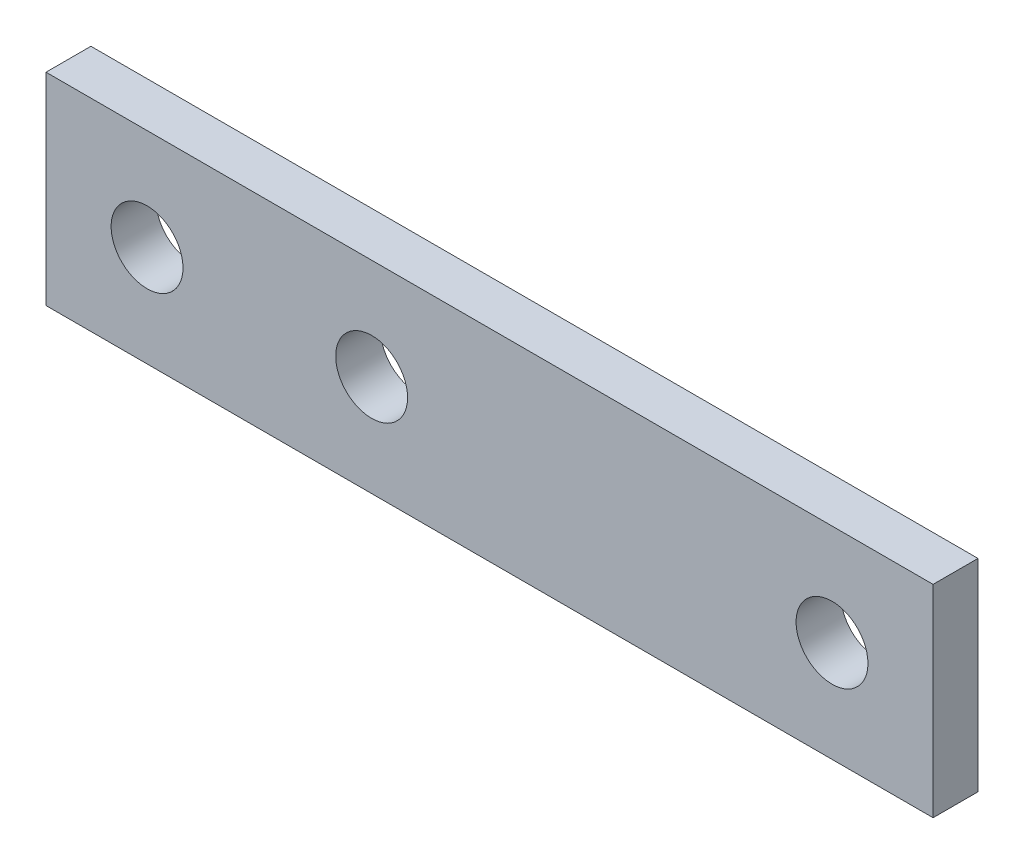
ISO-10303-21;
HEADER;
FILE_DESCRIPTION(('STEP AP214'),'2;1');
FILE_NAME('part.step','',(''),(''),'','','');
FILE_SCHEMA(('AUTOMOTIVE_DESIGN { 1 0 10303 214 1 1 1 1 }'));
ENDSEC;
DATA;
#1=APPLICATION_CONTEXT('core data for automotive mechanical design processes');
#2=APPLICATION_PROTOCOL_DEFINITION('international standard','automotive_design',2000,#1);
#3=PRODUCT_CONTEXT('',#1,'mechanical');
#4=PRODUCT('Part','Part','',(#3));
#5=PRODUCT_RELATED_PRODUCT_CATEGORY('part','',(#4));
#6=PRODUCT_DEFINITION_FORMATION('','',#4);
#7=PRODUCT_DEFINITION_CONTEXT('part definition',#1,'design');
#8=PRODUCT_DEFINITION('design','',#6,#7);
#9=PRODUCT_DEFINITION_SHAPE('','',#8);
#10=(LENGTH_UNIT() NAMED_UNIT(*) SI_UNIT(.MILLI.,.METRE.));
#11=(NAMED_UNIT(*) PLANE_ANGLE_UNIT() SI_UNIT($,.RADIAN.));
#12=(NAMED_UNIT(*) SI_UNIT($,.STERADIAN.) SOLID_ANGLE_UNIT());
#13=UNCERTAINTY_MEASURE_WITH_UNIT(LENGTH_MEASURE(1.E-05),#10,'distance_accuracy_value','');
#14=(GEOMETRIC_REPRESENTATION_CONTEXT(3) GLOBAL_UNCERTAINTY_ASSIGNED_CONTEXT((#13)) GLOBAL_UNIT_ASSIGNED_CONTEXT((#10,
#11,#12)) REPRESENTATION_CONTEXT('',''));
#15=CARTESIAN_POINT('',(0.,0.,0.));
#16=DIRECTION('',(0.,0.,1.));
#17=DIRECTION('',(1.,0.,0.));
#18=AXIS2_PLACEMENT_3D('',#15,#16,#17);
#19=CARTESIAN_POINT('',(19.75,4.5,2.));
#20=DIRECTION('',(-1.,0.,0.));
#21=DIRECTION('',(0.,0.,1.));
#22=AXIS2_PLACEMENT_3D('',#19,#20,#21);
#23=PLANE('',#22);
#24=DIRECTION('',(0.,1.,0.));
#25=VECTOR('',#24,1.);
#26=CARTESIAN_POINT('',(19.75,4.5,0.));
#27=LINE('',#26,#25);
#28=CARTESIAN_POINT('',(19.75,-4.5,0.));
#29=VERTEX_POINT('',#28);
#30=CARTESIAN_POINT('',(19.75,4.5,0.));
#31=VERTEX_POINT('',#30);
#32=EDGE_CURVE('E107',#29,#31,#27,.T.);
#33=ORIENTED_EDGE('',*,*,#32,.T.);
#34=DIRECTION('',(0.,0.,-1.));
#35=VECTOR('',#34,1.);
#36=CARTESIAN_POINT('',(19.75,4.5,2.));
#37=LINE('',#36,#35);
#38=CARTESIAN_POINT('',(19.75,4.5,2.));
#39=VERTEX_POINT('',#38);
#40=EDGE_CURVE('E11',#39,#31,#37,.T.);
#41=ORIENTED_EDGE('',*,*,#40,.F.);
#42=DIRECTION('',(0.,1.,0.));
#43=VECTOR('',#42,1.);
#44=CARTESIAN_POINT('',(19.75,4.5,2.));
#45=LINE('',#44,#43);
#46=CARTESIAN_POINT('',(19.75,-4.5,2.));
#47=VERTEX_POINT('',#46);
#48=EDGE_CURVE('E91',#47,#39,#45,.T.);
#49=ORIENTED_EDGE('',*,*,#48,.F.);
#50=DIRECTION('',(0.,0.,-1.));
#51=VECTOR('',#50,1.);
#52=CARTESIAN_POINT('',(19.75,-4.5,2.));
#53=LINE('',#52,#51);
#54=EDGE_CURVE('E103',#47,#29,#53,.T.);
#55=ORIENTED_EDGE('',*,*,#54,.T.);
#56=EDGE_LOOP('',(#33,#41,#49,#55));
#57=FACE_BOUND('',#56,.T.);
#58=ADVANCED_FACE('F39',(#57),#23,.F.);
#59=CARTESIAN_POINT('',(-19.75,4.5,2.));
#60=DIRECTION('',(0.,-1.,0.));
#61=DIRECTION('',(0.,0.,-1.));
#62=AXIS2_PLACEMENT_3D('',#59,#60,#61);
#63=PLANE('',#62);
#64=DIRECTION('',(-1.,0.,0.));
#65=VECTOR('',#64,1.);
#66=CARTESIAN_POINT('',(-19.75,4.5,0.));
#67=LINE('',#66,#65);
#68=CARTESIAN_POINT('',(-19.75,4.5,0.));
#69=VERTEX_POINT('',#68);
#70=EDGE_CURVE('E96',#31,#69,#67,.T.);
#71=ORIENTED_EDGE('',*,*,#70,.T.);
#72=DIRECTION('',(0.,0.,-1.));
#73=VECTOR('',#72,1.);
#74=CARTESIAN_POINT('',(-19.75,4.5,2.));
#75=LINE('',#74,#73);
#76=CARTESIAN_POINT('',(-19.75,4.5,2.));
#77=VERTEX_POINT('',#76);
#78=EDGE_CURVE('E48',#77,#69,#75,.T.);
#79=ORIENTED_EDGE('',*,*,#78,.F.);
#80=DIRECTION('',(-1.,0.,0.));
#81=VECTOR('',#80,1.);
#82=CARTESIAN_POINT('',(-19.75,4.5,2.));
#83=LINE('',#82,#81);
#84=EDGE_CURVE('E86',#39,#77,#83,.T.);
#85=ORIENTED_EDGE('',*,*,#84,.F.);
#86=ORIENTED_EDGE('',*,*,#40,.T.);
#87=EDGE_LOOP('',(#71,#79,#85,#86));
#88=FACE_BOUND('',#87,.T.);
#89=ADVANCED_FACE('F95',(#88),#63,.F.);
#90=CARTESIAN_POINT('',(-19.75,4.5,2.));
#91=DIRECTION('',(1.,0.,0.));
#92=DIRECTION('',(0.,1.,0.));
#93=AXIS2_PLACEMENT_3D('',#90,#91,#92);
#94=PLANE('',#93);
#95=DIRECTION('',(0.,-1.,0.));
#96=VECTOR('',#95,1.);
#97=CARTESIAN_POINT('',(-19.75,4.5,0.));
#98=LINE('',#97,#96);
#99=CARTESIAN_POINT('',(-19.75,-4.5,0.));
#100=VERTEX_POINT('',#99);
#101=EDGE_CURVE('E73',#69,#100,#98,.T.);
#102=ORIENTED_EDGE('',*,*,#101,.T.);
#103=DIRECTION('',(0.,0.,-1.));
#104=VECTOR('',#103,1.);
#105=CARTESIAN_POINT('',(-19.75,-4.5,2.));
#106=LINE('',#105,#104);
#107=CARTESIAN_POINT('',(-19.75,-4.5,2.));
#108=VERTEX_POINT('',#107);
#109=EDGE_CURVE('E98',#108,#100,#106,.T.);
#110=ORIENTED_EDGE('',*,*,#109,.F.);
#111=DIRECTION('',(0.,-1.,0.));
#112=VECTOR('',#111,1.);
#113=CARTESIAN_POINT('',(-19.75,4.5,2.));
#114=LINE('',#113,#112);
#115=EDGE_CURVE('E89',#77,#108,#114,.T.);
#116=ORIENTED_EDGE('',*,*,#115,.F.);
#117=ORIENTED_EDGE('',*,*,#78,.T.);
#118=EDGE_LOOP('',(#102,#110,#116,#117));
#119=FACE_BOUND('',#118,.T.);
#120=ADVANCED_FACE('F99',(#119),#94,.F.);
#121=CARTESIAN_POINT('',(-19.75,-4.5,2.));
#122=DIRECTION('',(0.,1.,0.));
#123=DIRECTION('',(0.,0.,1.));
#124=AXIS2_PLACEMENT_3D('',#121,#122,#123);
#125=PLANE('',#124);
#126=DIRECTION('',(1.,0.,0.));
#127=VECTOR('',#126,1.);
#128=CARTESIAN_POINT('',(-19.75,-4.5,0.));
#129=LINE('',#128,#127);
#130=EDGE_CURVE('E79',#100,#29,#129,.T.);
#131=ORIENTED_EDGE('',*,*,#130,.T.);
#132=ORIENTED_EDGE('',*,*,#54,.F.);
#133=DIRECTION('',(1.,0.,0.));
#134=VECTOR('',#133,1.);
#135=CARTESIAN_POINT('',(-19.75,-4.5,2.));
#136=LINE('',#135,#134);
#137=EDGE_CURVE('E56',#108,#47,#136,.T.);
#138=ORIENTED_EDGE('',*,*,#137,.F.);
#139=ORIENTED_EDGE('',*,*,#109,.T.);
#140=EDGE_LOOP('',(#131,#132,#138,#139));
#141=FACE_BOUND('',#140,.T.);
#142=ADVANCED_FACE('F121',(#141),#125,.F.);
#143=CARTESIAN_POINT('',(0.,0.,2.));
#144=DIRECTION('',(0.,0.,1.));
#145=DIRECTION('',(1.,0.,0.));
#146=AXIS2_PLACEMENT_3D('',#143,#144,#145);
#147=PLANE('',#146);
#148=CARTESIAN_POINT('',(-15.25,0.,2.));
#149=DIRECTION('',(0.,0.,1.));
#150=DIRECTION('',(1.,0.,0.));
#151=AXIS2_PLACEMENT_3D('',#148,#149,#150);
#152=CIRCLE('',#151,1.6);
#153=CARTESIAN_POINT('',(-13.65,0.,2.));
#154=VERTEX_POINT('',#153);
#155=EDGE_CURVE('E144',#154,#154,#152,.T.);
#156=ORIENTED_EDGE('',*,*,#155,.F.);
#157=EDGE_LOOP('',(#156));
#158=FACE_BOUND('',#157,.T.);
#159=CARTESIAN_POINT('',(-5.24999999999999,0.,2.));
#160=DIRECTION('',(0.,0.,1.));
#161=DIRECTION('',(1.,0.,0.));
#162=AXIS2_PLACEMENT_3D('',#159,#160,#161);
#163=CIRCLE('',#162,1.6);
#164=CARTESIAN_POINT('',(-3.64999999999999,0.,2.));
#165=VERTEX_POINT('',#164);
#166=EDGE_CURVE('E136',#165,#165,#163,.T.);
#167=ORIENTED_EDGE('',*,*,#166,.F.);
#168=EDGE_LOOP('',(#167));
#169=FACE_BOUND('',#168,.T.);
#170=CARTESIAN_POINT('',(15.25,0.,2.));
#171=DIRECTION('',(0.,0.,1.));
#172=DIRECTION('',(1.,0.,0.));
#173=AXIS2_PLACEMENT_3D('',#170,#171,#172);
#174=CIRCLE('',#173,1.6);
#175=CARTESIAN_POINT('',(16.85,0.,2.));
#176=VERTEX_POINT('',#175);
#177=EDGE_CURVE('E128',#176,#176,#174,.T.);
#178=ORIENTED_EDGE('',*,*,#177,.F.);
#179=EDGE_LOOP('',(#178));
#180=FACE_BOUND('',#179,.T.);
#181=ORIENTED_EDGE('',*,*,#48,.T.);
#182=ORIENTED_EDGE('',*,*,#84,.T.);
#183=ORIENTED_EDGE('',*,*,#115,.T.);
#184=ORIENTED_EDGE('',*,*,#137,.T.);
#185=EDGE_LOOP('',(#181,#182,#183,#184));
#186=FACE_BOUND('',#185,.T.);
#187=ADVANCED_FACE('F87',(#158,#169,#180,#186),#147,.T.);
#188=CARTESIAN_POINT('',(0.,0.,0.));
#189=DIRECTION('',(0.,0.,1.));
#190=DIRECTION('',(1.,0.,0.));
#191=AXIS2_PLACEMENT_3D('',#188,#189,#190);
#192=PLANE('',#191);
#193=CARTESIAN_POINT('',(-15.25,0.,0.));
#194=DIRECTION('',(0.,0.,1.));
#195=DIRECTION('',(1.,0.,0.));
#196=AXIS2_PLACEMENT_3D('',#193,#194,#195);
#197=CIRCLE('',#196,1.6);
#198=CARTESIAN_POINT('',(-13.65,0.,0.));
#199=VERTEX_POINT('',#198);
#200=EDGE_CURVE('E111',#199,#199,#197,.T.);
#201=ORIENTED_EDGE('',*,*,#200,.T.);
#202=EDGE_LOOP('',(#201));
#203=FACE_BOUND('',#202,.T.);
#204=CARTESIAN_POINT('',(-5.24999999999999,0.,0.));
#205=DIRECTION('',(0.,0.,1.));
#206=DIRECTION('',(1.,0.,0.));
#207=AXIS2_PLACEMENT_3D('',#204,#205,#206);
#208=CIRCLE('',#207,1.6);
#209=CARTESIAN_POINT('',(-3.64999999999999,0.,0.));
#210=VERTEX_POINT('',#209);
#211=EDGE_CURVE('E140',#210,#210,#208,.T.);
#212=ORIENTED_EDGE('',*,*,#211,.T.);
#213=EDGE_LOOP('',(#212));
#214=FACE_BOUND('',#213,.T.);
#215=CARTESIAN_POINT('',(15.25,0.,0.));
#216=DIRECTION('',(0.,0.,1.));
#217=DIRECTION('',(1.,0.,0.));
#218=AXIS2_PLACEMENT_3D('',#215,#216,#217);
#219=CIRCLE('',#218,1.6);
#220=CARTESIAN_POINT('',(16.85,0.,0.));
#221=VERTEX_POINT('',#220);
#222=EDGE_CURVE('E132',#221,#221,#219,.T.);
#223=ORIENTED_EDGE('',*,*,#222,.T.);
#224=EDGE_LOOP('',(#223));
#225=FACE_BOUND('',#224,.T.);
#226=ORIENTED_EDGE('',*,*,#32,.F.);
#227=ORIENTED_EDGE('',*,*,#130,.F.);
#228=ORIENTED_EDGE('',*,*,#101,.F.);
#229=ORIENTED_EDGE('',*,*,#70,.F.);
#230=EDGE_LOOP('',(#226,#227,#228,#229));
#231=FACE_BOUND('',#230,.T.);
#232=ADVANCED_FACE('F124',(#203,#214,#225,#231),#192,.F.);
#233=CARTESIAN_POINT('',(15.25,0.,0.));
#234=DIRECTION('',(0.,0.,1.));
#235=DIRECTION('',(1.,0.,0.));
#236=AXIS2_PLACEMENT_3D('',#233,#234,#235);
#237=CYLINDRICAL_SURFACE('',#236,1.6);
#238=ORIENTED_EDGE('',*,*,#222,.F.);
#239=EDGE_LOOP('',(#238));
#240=FACE_BOUND('',#239,.T.);
#241=ORIENTED_EDGE('',*,*,#177,.T.);
#242=EDGE_LOOP('',(#241));
#243=FACE_BOUND('',#242,.T.);
#244=ADVANCED_FACE('F168',(#240,#243),#237,.F.);
#245=CARTESIAN_POINT('',(-5.24999999999999,0.,0.));
#246=DIRECTION('',(0.,0.,1.));
#247=DIRECTION('',(1.,0.,0.));
#248=AXIS2_PLACEMENT_3D('',#245,#246,#247);
#249=CYLINDRICAL_SURFACE('',#248,1.6);
#250=ORIENTED_EDGE('',*,*,#211,.F.);
#251=EDGE_LOOP('',(#250));
#252=FACE_BOUND('',#251,.T.);
#253=ORIENTED_EDGE('',*,*,#166,.T.);
#254=EDGE_LOOP('',(#253));
#255=FACE_BOUND('',#254,.T.);
#256=ADVANCED_FACE('F157',(#252,#255),#249,.F.);
#257=CARTESIAN_POINT('',(-15.25,0.,0.));
#258=DIRECTION('',(0.,0.,1.));
#259=DIRECTION('',(1.,0.,0.));
#260=AXIS2_PLACEMENT_3D('',#257,#258,#259);
#261=CYLINDRICAL_SURFACE('',#260,1.6);
#262=ORIENTED_EDGE('',*,*,#200,.F.);
#263=EDGE_LOOP('',(#262));
#264=FACE_BOUND('',#263,.T.);
#265=ORIENTED_EDGE('',*,*,#155,.T.);
#266=EDGE_LOOP('',(#265));
#267=FACE_BOUND('',#266,.T.);
#268=ADVANCED_FACE('F154',(#264,#267),#261,.F.);
#269=CLOSED_SHELL('',(#58,#89,#120,#142,#187,#232,#244,#256,#268));
#270=MANIFOLD_SOLID_BREP('B2',#269);
#271=ADVANCED_BREP_SHAPE_REPRESENTATION('',(#18,#270),#14);
#272=SHAPE_DEFINITION_REPRESENTATION(#9,#271);
ENDSEC;
END-ISO-10303-21;
